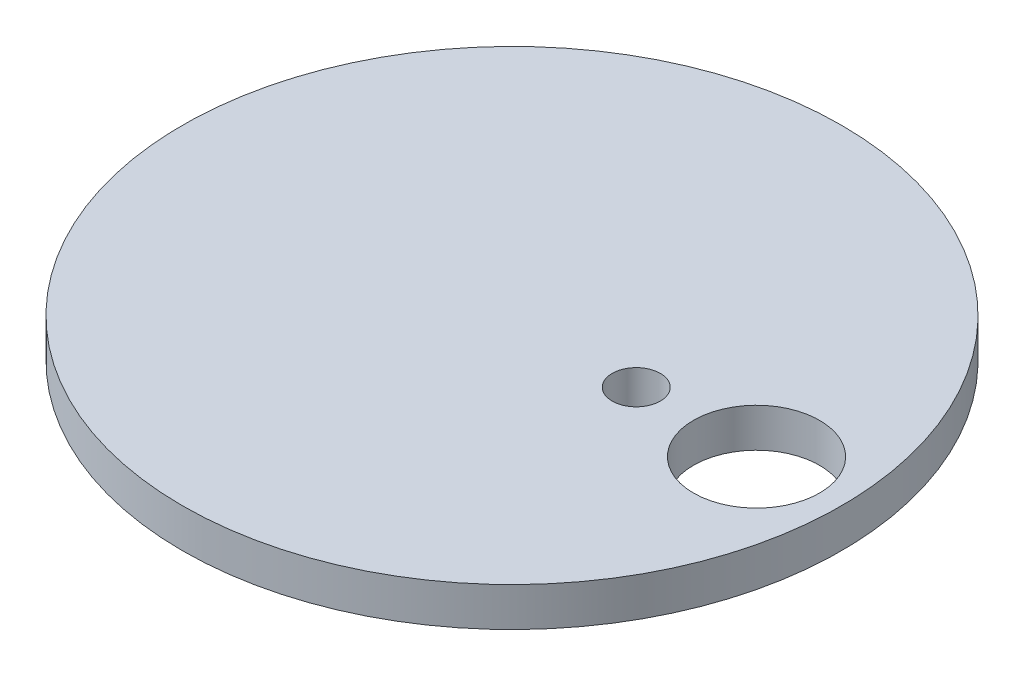
ISO-10303-21;
HEADER;
FILE_DESCRIPTION(('STEP AP214'),'2;1');
FILE_NAME('part.step','',(''),(''),'','','');
FILE_SCHEMA(('AUTOMOTIVE_DESIGN { 1 0 10303 214 1 1 1 1 }'));
ENDSEC;
DATA;
#1=APPLICATION_CONTEXT('core data for automotive mechanical design processes');
#2=APPLICATION_PROTOCOL_DEFINITION('international standard','automotive_design',2000,#1);
#3=PRODUCT_CONTEXT('',#1,'mechanical');
#4=PRODUCT('Part','Part','',(#3));
#5=PRODUCT_RELATED_PRODUCT_CATEGORY('part','',(#4));
#6=PRODUCT_DEFINITION_FORMATION('','',#4);
#7=PRODUCT_DEFINITION_CONTEXT('part definition',#1,'design');
#8=PRODUCT_DEFINITION('design','',#6,#7);
#9=PRODUCT_DEFINITION_SHAPE('','',#8);
#10=(LENGTH_UNIT() NAMED_UNIT(*) SI_UNIT(.MILLI.,.METRE.));
#11=(NAMED_UNIT(*) PLANE_ANGLE_UNIT() SI_UNIT($,.RADIAN.));
#12=(NAMED_UNIT(*) SI_UNIT($,.STERADIAN.) SOLID_ANGLE_UNIT());
#13=UNCERTAINTY_MEASURE_WITH_UNIT(LENGTH_MEASURE(1.E-05),#10,'distance_accuracy_value','');
#14=(GEOMETRIC_REPRESENTATION_CONTEXT(3) GLOBAL_UNCERTAINTY_ASSIGNED_CONTEXT((#13)) GLOBAL_UNIT_ASSIGNED_CONTEXT((#10,
#11,#12)) REPRESENTATION_CONTEXT('',''));
#15=CARTESIAN_POINT('',(0.,0.,0.));
#16=DIRECTION('',(0.,0.,1.));
#17=DIRECTION('',(1.,0.,0.));
#18=AXIS2_PLACEMENT_3D('',#15,#16,#17);
#19=CARTESIAN_POINT('',(0.,0.,0.));
#20=DIRECTION('',(0.,1.,0.));
#21=DIRECTION('',(0.,0.,1.));
#22=AXIS2_PLACEMENT_3D('',#19,#20,#21);
#23=PLANE('',#22);
#24=CARTESIAN_POINT('',(0.,0.,0.));
#25=DIRECTION('',(0.,1.,0.));
#26=DIRECTION('',(0.,0.,1.));
#27=AXIS2_PLACEMENT_3D('',#24,#25,#26);
#28=CIRCLE('',#27,4.1275);
#29=CARTESIAN_POINT('',(0.,0.,4.1275));
#30=VERTEX_POINT('',#29);
#31=EDGE_CURVE('E35',#30,#30,#28,.T.);
#32=ORIENTED_EDGE('',*,*,#31,.F.);
#33=EDGE_LOOP('',(#32));
#34=FACE_BOUND('',#33,.T.);
#35=CARTESIAN_POINT('',(0.,0.,0.));
#36=DIRECTION('',(0.,1.,0.));
#37=DIRECTION('',(0.,0.,1.));
#38=AXIS2_PLACEMENT_3D('',#35,#36,#37);
#39=CIRCLE('',#38,2.8575);
#40=CARTESIAN_POINT('',(0.,0.,2.8575));
#41=VERTEX_POINT('',#40);
#42=EDGE_CURVE('E42',#41,#41,#39,.T.);
#43=ORIENTED_EDGE('',*,*,#42,.T.);
#44=EDGE_LOOP('',(#43));
#45=FACE_BOUND('',#44,.T.);
#46=ADVANCED_FACE('F31',(#34,#45),#23,.F.);
#47=CARTESIAN_POINT('',(0.,3.6068,0.));
#48=DIRECTION('',(0.,-1.,0.));
#49=DIRECTION('',(0.,0.,-1.));
#50=AXIS2_PLACEMENT_3D('',#47,#48,#49);
#51=CYLINDRICAL_SURFACE('',#50,4.1275);
#52=CARTESIAN_POINT('',(0.,3.6068,0.));
#53=DIRECTION('',(0.,1.,0.));
#54=DIRECTION('',(0.,0.,1.));
#55=AXIS2_PLACEMENT_3D('',#52,#53,#54);
#56=CIRCLE('',#55,4.1275);
#57=CARTESIAN_POINT('',(0.,3.6068,4.1275));
#58=VERTEX_POINT('',#57);
#59=EDGE_CURVE('E10',#58,#58,#56,.T.);
#60=ORIENTED_EDGE('',*,*,#59,.F.);
#61=EDGE_LOOP('',(#60));
#62=FACE_BOUND('',#61,.T.);
#63=ORIENTED_EDGE('',*,*,#31,.T.);
#64=EDGE_LOOP('',(#63));
#65=FACE_BOUND('',#64,.T.);
#66=ADVANCED_FACE('F33',(#62,#65),#51,.T.);
#67=CARTESIAN_POINT('',(0.,3.6068,0.));
#68=DIRECTION('',(0.,-1.,0.));
#69=DIRECTION('',(0.,0.,-1.));
#70=AXIS2_PLACEMENT_3D('',#67,#68,#69);
#71=CYLINDRICAL_SURFACE('',#70,2.8575);
#72=CARTESIAN_POINT('',(0.,3.6068,0.));
#73=DIRECTION('',(0.,1.,0.));
#74=DIRECTION('',(0.,0.,1.));
#75=AXIS2_PLACEMENT_3D('',#72,#73,#74);
#76=CIRCLE('',#75,2.8575);
#77=CARTESIAN_POINT('',(0.,3.6068,2.8575));
#78=VERTEX_POINT('',#77);
#79=EDGE_CURVE('E46',#78,#78,#76,.T.);
#80=ORIENTED_EDGE('',*,*,#79,.T.);
#81=EDGE_LOOP('',(#80));
#82=FACE_BOUND('',#81,.T.);
#83=ORIENTED_EDGE('',*,*,#42,.F.);
#84=EDGE_LOOP('',(#83));
#85=FACE_BOUND('',#84,.T.);
#86=ADVANCED_FACE('F95',(#82,#85),#71,.F.);
#87=CARTESIAN_POINT('',(0.,3.6068,0.));
#88=DIRECTION('',(0.,1.,0.));
#89=DIRECTION('',(0.,0.,1.));
#90=AXIS2_PLACEMENT_3D('',#87,#88,#89);
#91=PLANE('',#90);
#92=ORIENTED_EDGE('',*,*,#79,.F.);
#93=EDGE_LOOP('',(#92));
#94=FACE_BOUND('',#93,.T.);
#95=ADVANCED_FACE('F84',(#94),#91,.F.);
#96=CARTESIAN_POINT('',(12.90955,3.6068,0.));
#97=DIRECTION('',(0.,1.,0.));
#98=DIRECTION('',(0.,0.,1.));
#99=AXIS2_PLACEMENT_3D('',#96,#97,#98);
#100=CIRCLE('',#99,3.32740000000001);
#101=CARTESIAN_POINT('',(12.90955,3.6068,3.32740000000001));
#102=VERTEX_POINT('',#101);
#103=EDGE_CURVE('E56',#102,#102,#100,.T.);
#104=ORIENTED_EDGE('',*,*,#103,.T.);
#105=EDGE_LOOP('',(#104));
#106=FACE_BOUND('',#105,.T.);
#107=CARTESIAN_POINT('',(0.,3.6068,0.));
#108=DIRECTION('',(0.,1.,0.));
#109=DIRECTION('',(0.,0.,1.));
#110=AXIS2_PLACEMENT_3D('',#107,#108,#109);
#111=CIRCLE('',#110,17.399);
#112=CARTESIAN_POINT('',(0.,3.6068,17.399));
#113=VERTEX_POINT('',#112);
#114=EDGE_CURVE('E50',#113,#113,#111,.T.);
#115=ORIENTED_EDGE('',*,*,#114,.F.);
#116=EDGE_LOOP('',(#115));
#117=FACE_BOUND('',#116,.T.);
#118=CARTESIAN_POINT('',(6.55955,3.6068,0.));
#119=DIRECTION('',(0.,1.,0.));
#120=DIRECTION('',(0.,0.,1.));
#121=AXIS2_PLACEMENT_3D('',#118,#119,#120);
#122=CIRCLE('',#121,1.27);
#123=CARTESIAN_POINT('',(6.55955,3.6068,1.27));
#124=VERTEX_POINT('',#123);
#125=EDGE_CURVE('E62',#124,#124,#122,.T.);
#126=ORIENTED_EDGE('',*,*,#125,.T.);
#127=EDGE_LOOP('',(#126));
#128=FACE_BOUND('',#127,.T.);
#129=ORIENTED_EDGE('',*,*,#59,.T.);
#130=EDGE_LOOP('',(#129));
#131=FACE_BOUND('',#130,.T.);
#132=ADVANCED_FACE('F74',(#106,#117,#128,#131),#91,.F.);
#133=CARTESIAN_POINT('',(0.,5.6642,0.));
#134=DIRECTION('',(0.,1.,0.));
#135=DIRECTION('',(0.,0.,1.));
#136=AXIS2_PLACEMENT_3D('',#133,#134,#135);
#137=PLANE('',#136);
#138=CARTESIAN_POINT('',(12.90955,5.6642,0.));
#139=DIRECTION('',(0.,1.,0.));
#140=DIRECTION('',(0.,0.,1.));
#141=AXIS2_PLACEMENT_3D('',#138,#139,#140);
#142=CIRCLE('',#141,3.32740000000001);
#143=CARTESIAN_POINT('',(12.90955,5.6642,3.32740000000001));
#144=VERTEX_POINT('',#143);
#145=EDGE_CURVE('E53',#144,#144,#142,.T.);
#146=ORIENTED_EDGE('',*,*,#145,.F.);
#147=EDGE_LOOP('',(#146));
#148=FACE_BOUND('',#147,.T.);
#149=CARTESIAN_POINT('',(0.,5.6642,0.));
#150=DIRECTION('',(0.,1.,0.));
#151=DIRECTION('',(0.,0.,1.));
#152=AXIS2_PLACEMENT_3D('',#149,#150,#151);
#153=CIRCLE('',#152,17.399);
#154=CARTESIAN_POINT('',(0.,5.6642,17.399));
#155=VERTEX_POINT('',#154);
#156=EDGE_CURVE('E49',#155,#155,#153,.T.);
#157=ORIENTED_EDGE('',*,*,#156,.T.);
#158=EDGE_LOOP('',(#157));
#159=FACE_BOUND('',#158,.T.);
#160=CARTESIAN_POINT('',(6.55955,5.6642,0.));
#161=DIRECTION('',(0.,1.,0.));
#162=DIRECTION('',(0.,0.,1.));
#163=AXIS2_PLACEMENT_3D('',#160,#161,#162);
#164=CIRCLE('',#163,1.27);
#165=CARTESIAN_POINT('',(6.55955,5.6642,1.27));
#166=VERTEX_POINT('',#165);
#167=EDGE_CURVE('E59',#166,#166,#164,.T.);
#168=ORIENTED_EDGE('',*,*,#167,.F.);
#169=EDGE_LOOP('',(#168));
#170=FACE_BOUND('',#169,.T.);
#171=ADVANCED_FACE('F71',(#148,#159,#170),#137,.T.);
#172=CARTESIAN_POINT('',(0.,5.6642,0.));
#173=DIRECTION('',(0.,-1.,0.));
#174=DIRECTION('',(0.,0.,-1.));
#175=AXIS2_PLACEMENT_3D('',#172,#173,#174);
#176=CYLINDRICAL_SURFACE('',#175,17.399);
#177=ORIENTED_EDGE('',*,*,#156,.F.);
#178=EDGE_LOOP('',(#177));
#179=FACE_BOUND('',#178,.T.);
#180=ORIENTED_EDGE('',*,*,#114,.T.);
#181=EDGE_LOOP('',(#180));
#182=FACE_BOUND('',#181,.T.);
#183=ADVANCED_FACE('F73',(#179,#182),#176,.T.);
#184=CARTESIAN_POINT('',(12.90955,5.6642,0.));
#185=DIRECTION('',(0.,-1.,0.));
#186=DIRECTION('',(0.,0.,-1.));
#187=AXIS2_PLACEMENT_3D('',#184,#185,#186);
#188=CYLINDRICAL_SURFACE('',#187,3.32740000000001);
#189=ORIENTED_EDGE('',*,*,#145,.T.);
#190=EDGE_LOOP('',(#189));
#191=FACE_BOUND('',#190,.T.);
#192=ORIENTED_EDGE('',*,*,#103,.F.);
#193=EDGE_LOOP('',(#192));
#194=FACE_BOUND('',#193,.T.);
#195=ADVANCED_FACE('F81',(#191,#194),#188,.F.);
#196=CARTESIAN_POINT('',(6.55955,5.6642,0.));
#197=DIRECTION('',(0.,-1.,0.));
#198=DIRECTION('',(0.,0.,-1.));
#199=AXIS2_PLACEMENT_3D('',#196,#197,#198);
#200=CYLINDRICAL_SURFACE('',#199,1.27);
#201=ORIENTED_EDGE('',*,*,#167,.T.);
#202=EDGE_LOOP('',(#201));
#203=FACE_BOUND('',#202,.T.);
#204=ORIENTED_EDGE('',*,*,#125,.F.);
#205=EDGE_LOOP('',(#204));
#206=FACE_BOUND('',#205,.T.);
#207=ADVANCED_FACE('F68',(#203,#206),#200,.F.);
#208=CLOSED_SHELL('',(#46,#66,#86,#95,#132,#171,#183,#195,#207));
#209=MANIFOLD_SOLID_BREP('B2',#208);
#210=ADVANCED_BREP_SHAPE_REPRESENTATION('',(#18,#209),#14);
#211=SHAPE_DEFINITION_REPRESENTATION(#9,#210);
ENDSEC;
END-ISO-10303-21;
